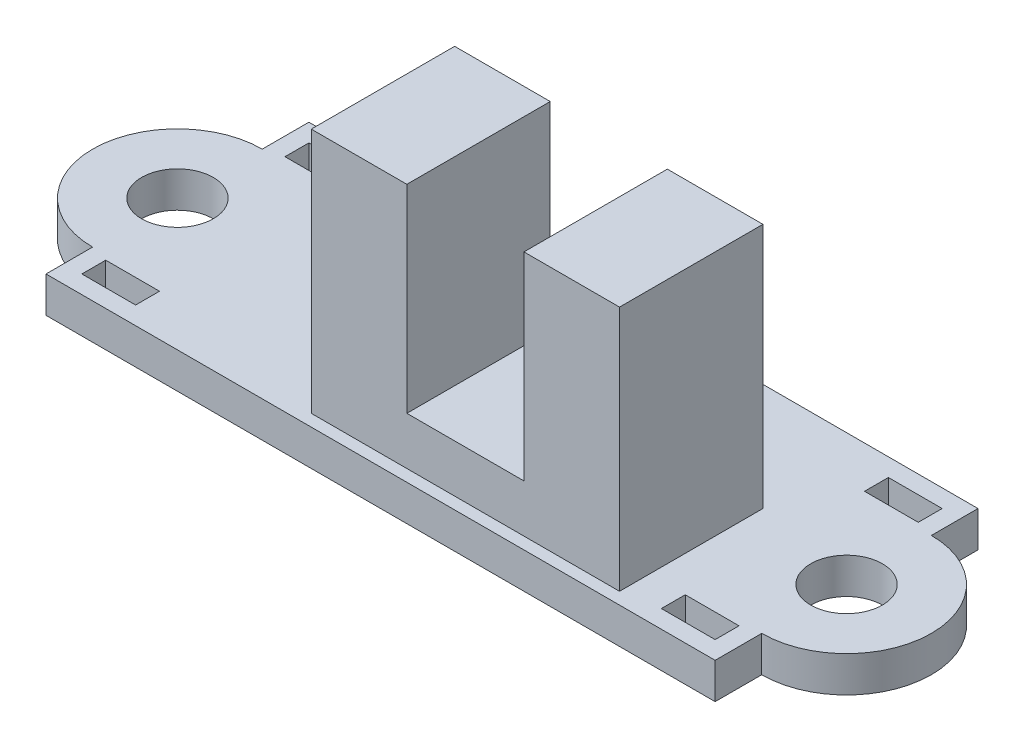
ISO-10303-21;
HEADER;
FILE_DESCRIPTION(('STEP AP214'),'2;1');
FILE_NAME('part.step','',(''),(''),'','','');
FILE_SCHEMA(('AUTOMOTIVE_DESIGN { 1 0 10303 214 1 1 1 1 }'));
ENDSEC;
DATA;
#1=APPLICATION_CONTEXT('core data for automotive mechanical design processes');
#2=APPLICATION_PROTOCOL_DEFINITION('international standard','automotive_design',2000,#1);
#3=PRODUCT_CONTEXT('',#1,'mechanical');
#4=PRODUCT('Part','Part','',(#3));
#5=PRODUCT_RELATED_PRODUCT_CATEGORY('part','',(#4));
#6=PRODUCT_DEFINITION_FORMATION('','',#4);
#7=PRODUCT_DEFINITION_CONTEXT('part definition',#1,'design');
#8=PRODUCT_DEFINITION('design','',#6,#7);
#9=PRODUCT_DEFINITION_SHAPE('','',#8);
#10=(LENGTH_UNIT() NAMED_UNIT(*) SI_UNIT(.MILLI.,.METRE.));
#11=(NAMED_UNIT(*) PLANE_ANGLE_UNIT() SI_UNIT($,.RADIAN.));
#12=(NAMED_UNIT(*) SI_UNIT($,.STERADIAN.) SOLID_ANGLE_UNIT());
#13=UNCERTAINTY_MEASURE_WITH_UNIT(LENGTH_MEASURE(1.E-05),#10,'distance_accuracy_value','');
#14=(GEOMETRIC_REPRESENTATION_CONTEXT(3) GLOBAL_UNCERTAINTY_ASSIGNED_CONTEXT((#13)) GLOBAL_UNIT_ASSIGNED_CONTEXT((#10,
#11,#12)) REPRESENTATION_CONTEXT('',''));
#15=CARTESIAN_POINT('',(0.,0.,0.));
#16=DIRECTION('',(0.,0.,1.));
#17=DIRECTION('',(1.,0.,0.));
#18=AXIS2_PLACEMENT_3D('',#15,#16,#17);
#19=CARTESIAN_POINT('',(0.,11.8,0.));
#20=DIRECTION('',(0.,1.,0.));
#21=DIRECTION('',(0.,0.,1.));
#22=AXIS2_PLACEMENT_3D('',#19,#20,#21);
#23=PLANE('',#22);
#24=DIRECTION('',(0.,0.,1.));
#25=VECTOR('',#24,1.);
#26=CARTESIAN_POINT('',(0.600000000000003,11.8,5.));
#27=LINE('',#26,#25);
#28=CARTESIAN_POINT('',(0.600000000000003,11.8,-0.999999999999997));
#29=VERTEX_POINT('',#28);
#30=CARTESIAN_POINT('',(0.600000000000003,11.8,5.));
#31=VERTEX_POINT('',#30);
#32=EDGE_CURVE('E131',#29,#31,#27,.T.);
#33=ORIENTED_EDGE('',*,*,#32,.F.);
#34=DIRECTION('',(-1.,0.,0.));
#35=VECTOR('',#34,1.);
#36=CARTESIAN_POINT('',(9.5,11.8,-0.999999999999997));
#37=LINE('',#36,#35);
#38=CARTESIAN_POINT('',(-3.4,11.8,-0.999999999999996));
#39=VERTEX_POINT('',#38);
#40=EDGE_CURVE('E162',#29,#39,#37,.T.);
#41=ORIENTED_EDGE('',*,*,#40,.T.);
#42=DIRECTION('',(0.,0.,1.));
#43=VECTOR('',#42,1.);
#44=CARTESIAN_POINT('',(-3.4,11.8,5.));
#45=LINE('',#44,#43);
#46=CARTESIAN_POINT('',(-3.4,11.8,5.));
#47=VERTEX_POINT('',#46);
#48=EDGE_CURVE('E164',#39,#47,#45,.T.);
#49=ORIENTED_EDGE('',*,*,#48,.T.);
#50=DIRECTION('',(1.,0.,0.));
#51=VECTOR('',#50,1.);
#52=CARTESIAN_POINT('',(9.5,11.8,5.));
#53=LINE('',#52,#51);
#54=EDGE_CURVE('E166',#47,#31,#53,.T.);
#55=ORIENTED_EDGE('',*,*,#54,.T.);
#56=EDGE_LOOP('',(#33,#41,#49,#55));
#57=FACE_BOUND('',#56,.T.);
#58=ADVANCED_FACE('F51',(#57),#23,.T.);
#59=CARTESIAN_POINT('',(9.5,11.8,5.));
#60=DIRECTION('',(-1.,0.,0.));
#61=DIRECTION('',(0.,0.,1.));
#62=AXIS2_PLACEMENT_3D('',#59,#60,#61);
#63=PLANE('',#62);
#64=DIRECTION('',(0.,0.,-1.));
#65=VECTOR('',#64,1.);
#66=CARTESIAN_POINT('',(9.5,1.5,5.));
#67=LINE('',#66,#65);
#68=CARTESIAN_POINT('',(9.5,1.5,5.));
#69=VERTEX_POINT('',#68);
#70=CARTESIAN_POINT('',(9.5,1.5,-0.999999999999997));
#71=VERTEX_POINT('',#70);
#72=EDGE_CURVE('E156',#69,#71,#67,.T.);
#73=ORIENTED_EDGE('',*,*,#72,.T.);
#74=DIRECTION('',(0.,-1.,0.));
#75=VECTOR('',#74,1.);
#76=CARTESIAN_POINT('',(9.5,11.8,-0.999999999999997));
#77=LINE('',#76,#75);
#78=CARTESIAN_POINT('',(9.5,11.8,-0.999999999999997));
#79=VERTEX_POINT('',#78);
#80=EDGE_CURVE('E12',#79,#71,#77,.T.);
#81=ORIENTED_EDGE('',*,*,#80,.F.);
#82=DIRECTION('',(0.,0.,-1.));
#83=VECTOR('',#82,1.);
#84=CARTESIAN_POINT('',(9.5,11.8,5.));
#85=LINE('',#84,#83);
#86=CARTESIAN_POINT('',(9.5,11.8,5.));
#87=VERTEX_POINT('',#86);
#88=EDGE_CURVE('E160',#87,#79,#85,.T.);
#89=ORIENTED_EDGE('',*,*,#88,.F.);
#90=DIRECTION('',(0.,-1.,0.));
#91=VECTOR('',#90,1.);
#92=CARTESIAN_POINT('',(9.5,11.8,5.));
#93=LINE('',#92,#91);
#94=EDGE_CURVE('E168',#87,#69,#93,.T.);
#95=ORIENTED_EDGE('',*,*,#94,.T.);
#96=EDGE_LOOP('',(#73,#81,#89,#95));
#97=FACE_BOUND('',#96,.T.);
#98=ADVANCED_FACE('F53',(#97),#63,.F.);
#99=CARTESIAN_POINT('',(9.5,11.8,-0.999999999999997));
#100=DIRECTION('',(0.,0.,1.));
#101=DIRECTION('',(1.,0.,0.));
#102=AXIS2_PLACEMENT_3D('',#99,#100,#101);
#103=PLANE('',#102);
#104=ORIENTED_EDGE('',*,*,#40,.F.);
#105=DIRECTION('',(0.,1.,0.));
#106=VECTOR('',#105,1.);
#107=CARTESIAN_POINT('',(0.600000000000003,3.5,-0.999999999999997));
#108=LINE('',#107,#106);
#109=CARTESIAN_POINT('',(0.600000000000003,3.5,-0.999999999999997));
#110=VERTEX_POINT('',#109);
#111=EDGE_CURVE('E154',#110,#29,#108,.T.);
#112=ORIENTED_EDGE('',*,*,#111,.F.);
#113=DIRECTION('',(-1.,0.,0.));
#114=VECTOR('',#113,1.);
#115=CARTESIAN_POINT('',(0.600000000000003,3.5,-0.999999999999997));
#116=LINE('',#115,#114);
#117=CARTESIAN_POINT('',(5.5,3.5,-0.999999999999997));
#118=VERTEX_POINT('',#117);
#119=EDGE_CURVE('E135',#118,#110,#116,.T.);
#120=ORIENTED_EDGE('',*,*,#119,.F.);
#121=DIRECTION('',(0.,1.,0.));
#122=VECTOR('',#121,1.);
#123=CARTESIAN_POINT('',(5.5,3.5,-0.999999999999997));
#124=LINE('',#123,#122);
#125=CARTESIAN_POINT('',(5.5,11.8,-0.999999999999997));
#126=VERTEX_POINT('',#125);
#127=EDGE_CURVE('E157',#118,#126,#124,.T.);
#128=ORIENTED_EDGE('',*,*,#127,.T.);
#129=EDGE_CURVE('E103',#79,#126,#37,.T.);
#130=ORIENTED_EDGE('',*,*,#129,.F.);
#131=ORIENTED_EDGE('',*,*,#80,.T.);
#132=DIRECTION('',(-1.,0.,0.));
#133=VECTOR('',#132,1.);
#134=CARTESIAN_POINT('',(9.5,1.5,-0.999999999999997));
#135=LINE('',#134,#133);
#136=CARTESIAN_POINT('',(-3.4,1.5,-0.999999999999996));
#137=VERTEX_POINT('',#136);
#138=EDGE_CURVE('E171',#71,#137,#135,.T.);
#139=ORIENTED_EDGE('',*,*,#138,.T.);
#140=DIRECTION('',(0.,-1.,0.));
#141=VECTOR('',#140,1.);
#142=CARTESIAN_POINT('',(-3.4,11.8,-0.999999999999996));
#143=LINE('',#142,#141);
#144=EDGE_CURVE('E59',#39,#137,#143,.T.);
#145=ORIENTED_EDGE('',*,*,#144,.F.);
#146=EDGE_LOOP('',(#104,#112,#120,#128,#130,#131,#139,#145));
#147=FACE_BOUND('',#146,.T.);
#148=ADVANCED_FACE('F194',(#147),#103,.F.);
#149=CARTESIAN_POINT('',(-3.4,11.8,5.));
#150=DIRECTION('',(1.,0.,0.));
#151=DIRECTION('',(0.,0.,-1.));
#152=AXIS2_PLACEMENT_3D('',#149,#150,#151);
#153=PLANE('',#152);
#154=DIRECTION('',(0.,0.,1.));
#155=VECTOR('',#154,1.);
#156=CARTESIAN_POINT('',(-3.4,1.5,5.));
#157=LINE('',#156,#155);
#158=CARTESIAN_POINT('',(-3.4,1.5,5.));
#159=VERTEX_POINT('',#158);
#160=EDGE_CURVE('E173',#137,#159,#157,.T.);
#161=ORIENTED_EDGE('',*,*,#160,.T.);
#162=DIRECTION('',(0.,-1.,0.));
#163=VECTOR('',#162,1.);
#164=CARTESIAN_POINT('',(-3.4,11.8,5.));
#165=LINE('',#164,#163);
#166=EDGE_CURVE('E177',#47,#159,#165,.T.);
#167=ORIENTED_EDGE('',*,*,#166,.F.);
#168=ORIENTED_EDGE('',*,*,#48,.F.);
#169=ORIENTED_EDGE('',*,*,#144,.T.);
#170=EDGE_LOOP('',(#161,#167,#168,#169));
#171=FACE_BOUND('',#170,.T.);
#172=ADVANCED_FACE('F183',(#171),#153,.F.);
#173=CARTESIAN_POINT('',(9.5,11.8,5.));
#174=DIRECTION('',(0.,0.,-1.));
#175=DIRECTION('',(-1.,0.,0.));
#176=AXIS2_PLACEMENT_3D('',#173,#174,#175);
#177=PLANE('',#176);
#178=DIRECTION('',(1.,0.,0.));
#179=VECTOR('',#178,1.);
#180=CARTESIAN_POINT('',(0.600000000000003,3.5,5.));
#181=LINE('',#180,#179);
#182=CARTESIAN_POINT('',(0.600000000000003,3.5,5.));
#183=VERTEX_POINT('',#182);
#184=CARTESIAN_POINT('',(5.5,3.5,5.));
#185=VERTEX_POINT('',#184);
#186=EDGE_CURVE('E141',#183,#185,#181,.T.);
#187=ORIENTED_EDGE('',*,*,#186,.F.);
#188=DIRECTION('',(0.,1.,0.));
#189=VECTOR('',#188,1.);
#190=CARTESIAN_POINT('',(0.600000000000003,3.5,5.));
#191=LINE('',#190,#189);
#192=EDGE_CURVE('E125',#183,#31,#191,.T.);
#193=ORIENTED_EDGE('',*,*,#192,.T.);
#194=ORIENTED_EDGE('',*,*,#54,.F.);
#195=ORIENTED_EDGE('',*,*,#166,.T.);
#196=DIRECTION('',(1.,0.,0.));
#197=VECTOR('',#196,1.);
#198=CARTESIAN_POINT('',(9.5,1.5,5.));
#199=LINE('',#198,#197);
#200=EDGE_CURVE('E96',#159,#69,#199,.T.);
#201=ORIENTED_EDGE('',*,*,#200,.T.);
#202=ORIENTED_EDGE('',*,*,#94,.F.);
#203=CARTESIAN_POINT('',(5.5,11.8,5.));
#204=VERTEX_POINT('',#203);
#205=EDGE_CURVE('E74',#204,#87,#53,.T.);
#206=ORIENTED_EDGE('',*,*,#205,.F.);
#207=DIRECTION('',(0.,1.,0.));
#208=VECTOR('',#207,1.);
#209=CARTESIAN_POINT('',(5.5,3.5,5.));
#210=LINE('',#209,#208);
#211=EDGE_CURVE('E66',#185,#204,#210,.T.);
#212=ORIENTED_EDGE('',*,*,#211,.F.);
#213=EDGE_LOOP('',(#187,#193,#194,#195,#201,#202,#206,#212));
#214=FACE_BOUND('',#213,.T.);
#215=ADVANCED_FACE('F146',(#214),#177,.F.);
#216=DIRECTION('',(0.,0.,-1.));
#217=VECTOR('',#216,1.);
#218=CARTESIAN_POINT('',(5.5,11.8,5.));
#219=LINE('',#218,#217);
#220=EDGE_CURVE('E144',#204,#126,#219,.T.);
#221=ORIENTED_EDGE('',*,*,#220,.F.);
#222=ORIENTED_EDGE('',*,*,#205,.T.);
#223=ORIENTED_EDGE('',*,*,#88,.T.);
#224=ORIENTED_EDGE('',*,*,#129,.T.);
#225=EDGE_LOOP('',(#221,#222,#223,#224));
#226=FACE_BOUND('',#225,.T.);
#227=ADVANCED_FACE('F192',(#226),#23,.T.);
#228=CARTESIAN_POINT('',(0.,1.5,0.));
#229=DIRECTION('',(0.,1.,0.));
#230=DIRECTION('',(0.,0.,1.));
#231=AXIS2_PLACEMENT_3D('',#228,#229,#230);
#232=PLANE('',#231);
#233=ORIENTED_EDGE('',*,*,#72,.F.);
#234=ORIENTED_EDGE('',*,*,#200,.F.);
#235=ORIENTED_EDGE('',*,*,#160,.F.);
#236=ORIENTED_EDGE('',*,*,#138,.F.);
#237=EDGE_LOOP('',(#233,#234,#235,#236));
#238=FACE_BOUND('',#237,.T.);
#239=ADVANCED_FACE('F188',(#238),#232,.F.);
#240=CARTESIAN_POINT('',(0.600000000000003,3.5,5.));
#241=DIRECTION('',(-1.,0.,0.));
#242=DIRECTION('',(0.,0.,1.));
#243=AXIS2_PLACEMENT_3D('',#240,#241,#242);
#244=PLANE('',#243);
#245=ORIENTED_EDGE('',*,*,#32,.T.);
#246=ORIENTED_EDGE('',*,*,#192,.F.);
#247=DIRECTION('',(0.,0.,1.));
#248=VECTOR('',#247,1.);
#249=CARTESIAN_POINT('',(0.600000000000003,3.5,5.));
#250=LINE('',#249,#248);
#251=EDGE_CURVE('E128',#110,#183,#250,.T.);
#252=ORIENTED_EDGE('',*,*,#251,.F.);
#253=ORIENTED_EDGE('',*,*,#111,.T.);
#254=EDGE_LOOP('',(#245,#246,#252,#253));
#255=FACE_BOUND('',#254,.T.);
#256=ADVANCED_FACE('F127',(#255),#244,.F.);
#257=CARTESIAN_POINT('',(5.5,3.5,5.));
#258=DIRECTION('',(1.,0.,0.));
#259=DIRECTION('',(0.,0.,-1.));
#260=AXIS2_PLACEMENT_3D('',#257,#258,#259);
#261=PLANE('',#260);
#262=ORIENTED_EDGE('',*,*,#220,.T.);
#263=ORIENTED_EDGE('',*,*,#127,.F.);
#264=DIRECTION('',(0.,0.,-1.));
#265=VECTOR('',#264,1.);
#266=CARTESIAN_POINT('',(5.5,3.5,5.));
#267=LINE('',#266,#265);
#268=EDGE_CURVE('E147',#185,#118,#267,.T.);
#269=ORIENTED_EDGE('',*,*,#268,.F.);
#270=ORIENTED_EDGE('',*,*,#211,.T.);
#271=EDGE_LOOP('',(#262,#263,#269,#270));
#272=FACE_BOUND('',#271,.T.);
#273=ADVANCED_FACE('F193',(#272),#261,.F.);
#274=CARTESIAN_POINT('',(0.,3.5,0.));
#275=DIRECTION('',(0.,-1.,0.));
#276=DIRECTION('',(0.,0.,-1.));
#277=AXIS2_PLACEMENT_3D('',#274,#275,#276);
#278=PLANE('',#277);
#279=ORIENTED_EDGE('',*,*,#251,.T.);
#280=ORIENTED_EDGE('',*,*,#186,.T.);
#281=ORIENTED_EDGE('',*,*,#268,.T.);
#282=ORIENTED_EDGE('',*,*,#119,.T.);
#283=EDGE_LOOP('',(#279,#280,#281,#282));
#284=FACE_BOUND('',#283,.T.);
#285=ADVANCED_FACE('F139',(#284),#278,.F.);
#286=CLOSED_SHELL('',(#58,#98,#148,#172,#215,#227,#239,#256,#273,#285));
#287=MANIFOLD_SOLID_BREP('B2',#286);
#288=CARTESIAN_POINT('',(-14.,1.5,0.));
#289=DIRECTION('',(0.,1.,0.));
#290=DIRECTION('',(0.,0.,1.));
#291=AXIS2_PLACEMENT_3D('',#288,#289,#290);
#292=PLANE('',#291);
#293=DIRECTION('',(0.,0.,-1.));
#294=VECTOR('',#293,1.);
#295=CARTESIAN_POINT('',(13.25,1.5,4.75));
#296=LINE('',#295,#294);
#297=CARTESIAN_POINT('',(13.25,1.5,4.75));
#298=VERTEX_POINT('',#297);
#299=CARTESIAN_POINT('',(13.25,1.5,3.75));
#300=VERTEX_POINT('',#299);
#301=EDGE_CURVE('E271',#298,#300,#296,.T.);
#302=ORIENTED_EDGE('',*,*,#301,.F.);
#303=DIRECTION('',(1.,0.,0.));
#304=VECTOR('',#303,1.);
#305=CARTESIAN_POINT('',(13.25,1.5,4.75));
#306=LINE('',#305,#304);
#307=CARTESIAN_POINT('',(11.,1.5,4.75));
#308=VERTEX_POINT('',#307);
#309=EDGE_CURVE('E496',#308,#298,#306,.T.);
#310=ORIENTED_EDGE('',*,*,#309,.F.);
#311=DIRECTION('',(0.,0.,1.));
#312=VECTOR('',#311,1.);
#313=CARTESIAN_POINT('',(11.,1.5,4.75));
#314=LINE('',#313,#312);
#315=CARTESIAN_POINT('',(11.,1.5,3.75));
#316=VERTEX_POINT('',#315);
#317=EDGE_CURVE('E510',#316,#308,#314,.T.);
#318=ORIENTED_EDGE('',*,*,#317,.F.);
#319=DIRECTION('',(-1.,0.,0.));
#320=VECTOR('',#319,1.);
#321=CARTESIAN_POINT('',(13.25,1.5,3.75));
#322=LINE('',#321,#320);
#323=EDGE_CURVE('E507',#300,#316,#322,.T.);
#324=ORIENTED_EDGE('',*,*,#323,.F.);
#325=EDGE_LOOP('',(#302,#310,#318,#324));
#326=FACE_BOUND('',#325,.T.);
#327=DIRECTION('',(-1.,0.,0.));
#328=VECTOR('',#327,1.);
#329=CARTESIAN_POINT('',(13.25,1.5,-4.75));
#330=LINE('',#329,#328);
#331=CARTESIAN_POINT('',(13.25,1.5,-4.75));
#332=VERTEX_POINT('',#331);
#333=CARTESIAN_POINT('',(11.,1.5,-4.75));
#334=VERTEX_POINT('',#333);
#335=EDGE_CURVE('E279',#332,#334,#330,.T.);
#336=ORIENTED_EDGE('',*,*,#335,.F.);
#337=DIRECTION('',(0.,0.,-1.));
#338=VECTOR('',#337,1.);
#339=CARTESIAN_POINT('',(13.25,1.5,-4.75));
#340=LINE('',#339,#338);
#341=CARTESIAN_POINT('',(13.25,1.5,-3.75));
#342=VERTEX_POINT('',#341);
#343=EDGE_CURVE('E466',#342,#332,#340,.T.);
#344=ORIENTED_EDGE('',*,*,#343,.F.);
#345=DIRECTION('',(1.,0.,0.));
#346=VECTOR('',#345,1.);
#347=CARTESIAN_POINT('',(13.25,1.5,-3.75));
#348=LINE('',#347,#346);
#349=CARTESIAN_POINT('',(11.,1.5,-3.75));
#350=VERTEX_POINT('',#349);
#351=EDGE_CURVE('E481',#350,#342,#348,.T.);
#352=ORIENTED_EDGE('',*,*,#351,.F.);
#353=DIRECTION('',(0.,0.,1.));
#354=VECTOR('',#353,1.);
#355=CARTESIAN_POINT('',(11.,1.5,-4.75));
#356=LINE('',#355,#354);
#357=EDGE_CURVE('E477',#334,#350,#356,.T.);
#358=ORIENTED_EDGE('',*,*,#357,.F.);
#359=EDGE_LOOP('',(#336,#344,#352,#358));
#360=FACE_BOUND('',#359,.T.);
#361=DIRECTION('',(0.,0.,1.));
#362=VECTOR('',#361,1.);
#363=CARTESIAN_POINT('',(-13.25,1.5,-4.75));
#364=LINE('',#363,#362);
#365=CARTESIAN_POINT('',(-13.25,1.5,-4.75));
#366=VERTEX_POINT('',#365);
#367=CARTESIAN_POINT('',(-13.25,1.5,-3.75));
#368=VERTEX_POINT('',#367);
#369=EDGE_CURVE('E424',#366,#368,#364,.T.);
#370=ORIENTED_EDGE('',*,*,#369,.F.);
#371=DIRECTION('',(-1.,0.,0.));
#372=VECTOR('',#371,1.);
#373=CARTESIAN_POINT('',(-13.25,1.5,-4.75));
#374=LINE('',#373,#372);
#375=CARTESIAN_POINT('',(-11.,1.5,-4.75));
#376=VERTEX_POINT('',#375);
#377=EDGE_CURVE('E442',#376,#366,#374,.T.);
#378=ORIENTED_EDGE('',*,*,#377,.F.);
#379=DIRECTION('',(0.,0.,-1.));
#380=VECTOR('',#379,1.);
#381=CARTESIAN_POINT('',(-11.,1.5,-4.75));
#382=LINE('',#381,#380);
#383=CARTESIAN_POINT('',(-11.,1.5,-3.75));
#384=VERTEX_POINT('',#383);
#385=EDGE_CURVE('E445',#384,#376,#382,.T.);
#386=ORIENTED_EDGE('',*,*,#385,.F.);
#387=DIRECTION('',(1.,0.,0.));
#388=VECTOR('',#387,1.);
#389=CARTESIAN_POINT('',(-13.25,1.5,-3.75));
#390=LINE('',#389,#388);
#391=EDGE_CURVE('E451',#368,#384,#390,.T.);
#392=ORIENTED_EDGE('',*,*,#391,.F.);
#393=EDGE_LOOP('',(#370,#378,#386,#392));
#394=FACE_BOUND('',#393,.T.);
#395=DIRECTION('',(0.,0.,1.));
#396=VECTOR('',#395,1.);
#397=CARTESIAN_POINT('',(-13.25,1.5,4.75));
#398=LINE('',#397,#396);
#399=CARTESIAN_POINT('',(-13.25,1.5,3.75));
#400=VERTEX_POINT('',#399);
#401=CARTESIAN_POINT('',(-13.25,1.5,4.75));
#402=VERTEX_POINT('',#401);
#403=EDGE_CURVE('E458',#400,#402,#398,.T.);
#404=ORIENTED_EDGE('',*,*,#403,.F.);
#405=DIRECTION('',(-1.,0.,0.));
#406=VECTOR('',#405,1.);
#407=CARTESIAN_POINT('',(-13.25,1.5,3.75));
#408=LINE('',#407,#406);
#409=CARTESIAN_POINT('',(-11.,1.5,3.75));
#410=VERTEX_POINT('',#409);
#411=EDGE_CURVE('E525',#410,#400,#408,.T.);
#412=ORIENTED_EDGE('',*,*,#411,.F.);
#413=DIRECTION('',(0.,0.,-1.));
#414=VECTOR('',#413,1.);
#415=CARTESIAN_POINT('',(-11.,1.5,4.75));
#416=LINE('',#415,#414);
#417=CARTESIAN_POINT('',(-11.,1.5,4.75));
#418=VERTEX_POINT('',#417);
#419=EDGE_CURVE('E539',#418,#410,#416,.T.);
#420=ORIENTED_EDGE('',*,*,#419,.F.);
#421=DIRECTION('',(1.,0.,0.));
#422=VECTOR('',#421,1.);
#423=CARTESIAN_POINT('',(-13.25,1.5,4.75));
#424=LINE('',#423,#422);
#425=EDGE_CURVE('E536',#402,#418,#424,.T.);
#426=ORIENTED_EDGE('',*,*,#425,.F.);
#427=EDGE_LOOP('',(#404,#412,#420,#426));
#428=FACE_BOUND('',#427,.T.);
#429=CARTESIAN_POINT('',(-14.,1.5,0.));
#430=DIRECTION('',(0.,1.,0.));
#431=DIRECTION('',(0.,0.,1.));
#432=AXIS2_PLACEMENT_3D('',#429,#430,#431);
#433=CIRCLE('',#432,1.5);
#434=CARTESIAN_POINT('',(-14.,1.5,1.5));
#435=VERTEX_POINT('',#434);
#436=EDGE_CURVE('E559',#435,#435,#433,.T.);
#437=ORIENTED_EDGE('',*,*,#436,.F.);
#438=EDGE_LOOP('',(#437));
#439=FACE_BOUND('',#438,.T.);
#440=CARTESIAN_POINT('',(-14.,1.5,0.));
#441=DIRECTION('',(0.,1.,0.));
#442=DIRECTION('',(0.,0.,1.));
#443=AXIS2_PLACEMENT_3D('',#440,#441,#442);
#444=CIRCLE('',#443,3.55);
#445=CARTESIAN_POINT('',(-14.,1.5,-3.55));
#446=VERTEX_POINT('',#445);
#447=CARTESIAN_POINT('',(-14.,1.5,3.55));
#448=VERTEX_POINT('',#447);
#449=EDGE_CURVE('E565',#446,#448,#444,.T.);
#450=ORIENTED_EDGE('',*,*,#449,.T.);
#451=DIRECTION('',(0.,0.,1.));
#452=VECTOR('',#451,1.);
#453=CARTESIAN_POINT('',(-14.,1.5,3.55));
#454=LINE('',#453,#452);
#455=CARTESIAN_POINT('',(-14.,1.5,5.5));
#456=VERTEX_POINT('',#455);
#457=EDGE_CURVE('E568',#448,#456,#454,.T.);
#458=ORIENTED_EDGE('',*,*,#457,.T.);
#459=DIRECTION('',(1.,0.,0.));
#460=VECTOR('',#459,1.);
#461=CARTESIAN_POINT('',(-14.,1.5,5.5));
#462=LINE('',#461,#460);
#463=CARTESIAN_POINT('',(14.,1.5,5.5));
#464=VERTEX_POINT('',#463);
#465=EDGE_CURVE('E571',#456,#464,#462,.T.);
#466=ORIENTED_EDGE('',*,*,#465,.T.);
#467=DIRECTION('',(0.,0.,-1.));
#468=VECTOR('',#467,1.);
#469=CARTESIAN_POINT('',(14.,1.5,3.55));
#470=LINE('',#469,#468);
#471=CARTESIAN_POINT('',(14.,1.5,3.55));
#472=VERTEX_POINT('',#471);
#473=EDGE_CURVE('E573',#464,#472,#470,.T.);
#474=ORIENTED_EDGE('',*,*,#473,.T.);
#475=CARTESIAN_POINT('',(14.,1.5,0.));
#476=DIRECTION('',(0.,1.,0.));
#477=DIRECTION('',(0.,0.,-1.));
#478=AXIS2_PLACEMENT_3D('',#475,#476,#477);
#479=CIRCLE('',#478,3.55);
#480=CARTESIAN_POINT('',(14.,1.5,-3.55));
#481=VERTEX_POINT('',#480);
#482=EDGE_CURVE('E575',#472,#481,#479,.T.);
#483=ORIENTED_EDGE('',*,*,#482,.T.);
#484=DIRECTION('',(0.,0.,-1.));
#485=VECTOR('',#484,1.);
#486=CARTESIAN_POINT('',(14.,1.5,-3.55));
#487=LINE('',#486,#485);
#488=CARTESIAN_POINT('',(14.,1.5,-5.5));
#489=VERTEX_POINT('',#488);
#490=EDGE_CURVE('E577',#481,#489,#487,.T.);
#491=ORIENTED_EDGE('',*,*,#490,.T.);
#492=DIRECTION('',(-1.,0.,0.));
#493=VECTOR('',#492,1.);
#494=CARTESIAN_POINT('',(-14.,1.5,-5.5));
#495=LINE('',#494,#493);
#496=CARTESIAN_POINT('',(-14.,1.5,-5.5));
#497=VERTEX_POINT('',#496);
#498=EDGE_CURVE('E579',#489,#497,#495,.T.);
#499=ORIENTED_EDGE('',*,*,#498,.T.);
#500=DIRECTION('',(0.,0.,1.));
#501=VECTOR('',#500,1.);
#502=CARTESIAN_POINT('',(-14.,1.5,-3.55));
#503=LINE('',#502,#501);
#504=EDGE_CURVE('E581',#497,#446,#503,.T.);
#505=ORIENTED_EDGE('',*,*,#504,.T.);
#506=EDGE_LOOP('',(#450,#458,#466,#474,#483,#491,#499,#505));
#507=FACE_BOUND('',#506,.T.);
#508=CARTESIAN_POINT('',(14.,1.5,0.));
#509=DIRECTION('',(0.,1.,0.));
#510=DIRECTION('',(0.,0.,1.));
#511=AXIS2_PLACEMENT_3D('',#508,#509,#510);
#512=CIRCLE('',#511,1.5);
#513=CARTESIAN_POINT('',(14.,1.5,1.5));
#514=VERTEX_POINT('',#513);
#515=EDGE_CURVE('E553',#514,#514,#512,.T.);
#516=ORIENTED_EDGE('',*,*,#515,.F.);
#517=EDGE_LOOP('',(#516));
#518=FACE_BOUND('',#517,.T.);
#519=ADVANCED_FACE('F256',(#326,#360,#394,#428,#439,#507,#518),#292,.T.);
#520=CARTESIAN_POINT('',(-14.,0.,0.));
#521=DIRECTION('',(0.,1.,0.));
#522=DIRECTION('',(0.,0.,1.));
#523=AXIS2_PLACEMENT_3D('',#520,#521,#522);
#524=PLANE('',#523);
#525=DIRECTION('',(1.,0.,0.));
#526=VECTOR('',#525,1.);
#527=CARTESIAN_POINT('',(13.25,0.,4.75));
#528=LINE('',#527,#526);
#529=CARTESIAN_POINT('',(11.,0.,4.75));
#530=VERTEX_POINT('',#529);
#531=CARTESIAN_POINT('',(13.25,0.,4.75));
#532=VERTEX_POINT('',#531);
#533=EDGE_CURVE('E502',#530,#532,#528,.T.);
#534=ORIENTED_EDGE('',*,*,#533,.T.);
#535=DIRECTION('',(0.,0.,-1.));
#536=VECTOR('',#535,1.);
#537=CARTESIAN_POINT('',(13.25,0.,4.75));
#538=LINE('',#537,#536);
#539=CARTESIAN_POINT('',(13.25,0.,3.75));
#540=VERTEX_POINT('',#539);
#541=EDGE_CURVE('E492',#532,#540,#538,.T.);
#542=ORIENTED_EDGE('',*,*,#541,.T.);
#543=DIRECTION('',(-1.,0.,0.));
#544=VECTOR('',#543,1.);
#545=CARTESIAN_POINT('',(13.25,0.,3.75));
#546=LINE('',#545,#544);
#547=CARTESIAN_POINT('',(11.,0.,3.75));
#548=VERTEX_POINT('',#547);
#549=EDGE_CURVE('E495',#540,#548,#546,.T.);
#550=ORIENTED_EDGE('',*,*,#549,.T.);
#551=DIRECTION('',(0.,0.,1.));
#552=VECTOR('',#551,1.);
#553=CARTESIAN_POINT('',(11.,0.,4.75));
#554=LINE('',#553,#552);
#555=EDGE_CURVE('E499',#548,#530,#554,.T.);
#556=ORIENTED_EDGE('',*,*,#555,.T.);
#557=EDGE_LOOP('',(#534,#542,#550,#556));
#558=FACE_BOUND('',#557,.T.);
#559=DIRECTION('',(0.,0.,-1.));
#560=VECTOR('',#559,1.);
#561=CARTESIAN_POINT('',(13.25,0.,-4.75));
#562=LINE('',#561,#560);
#563=CARTESIAN_POINT('',(13.25,0.,-3.75));
#564=VERTEX_POINT('',#563);
#565=CARTESIAN_POINT('',(13.25,0.,-4.75));
#566=VERTEX_POINT('',#565);
#567=EDGE_CURVE('E472',#564,#566,#562,.T.);
#568=ORIENTED_EDGE('',*,*,#567,.T.);
#569=DIRECTION('',(-1.,0.,0.));
#570=VECTOR('',#569,1.);
#571=CARTESIAN_POINT('',(13.25,0.,-4.75));
#572=LINE('',#571,#570);
#573=CARTESIAN_POINT('',(11.,0.,-4.75));
#574=VERTEX_POINT('',#573);
#575=EDGE_CURVE('E462',#566,#574,#572,.T.);
#576=ORIENTED_EDGE('',*,*,#575,.T.);
#577=DIRECTION('',(0.,0.,1.));
#578=VECTOR('',#577,1.);
#579=CARTESIAN_POINT('',(11.,0.,-4.75));
#580=LINE('',#579,#578);
#581=CARTESIAN_POINT('',(11.,0.,-3.75));
#582=VERTEX_POINT('',#581);
#583=EDGE_CURVE('E465',#574,#582,#580,.T.);
#584=ORIENTED_EDGE('',*,*,#583,.T.);
#585=DIRECTION('',(1.,0.,0.));
#586=VECTOR('',#585,1.);
#587=CARTESIAN_POINT('',(13.25,0.,-3.75));
#588=LINE('',#587,#586);
#589=EDGE_CURVE('E469',#582,#564,#588,.T.);
#590=ORIENTED_EDGE('',*,*,#589,.T.);
#591=EDGE_LOOP('',(#568,#576,#584,#590));
#592=FACE_BOUND('',#591,.T.);
#593=DIRECTION('',(-1.,0.,0.));
#594=VECTOR('',#593,1.);
#595=CARTESIAN_POINT('',(-13.25,0.,-4.75));
#596=LINE('',#595,#594);
#597=CARTESIAN_POINT('',(-11.,0.,-4.75));
#598=VERTEX_POINT('',#597);
#599=CARTESIAN_POINT('',(-13.25,0.,-4.75));
#600=VERTEX_POINT('',#599);
#601=EDGE_CURVE('E429',#598,#600,#596,.T.);
#602=ORIENTED_EDGE('',*,*,#601,.T.);
#603=DIRECTION('',(0.,0.,1.));
#604=VECTOR('',#603,1.);
#605=CARTESIAN_POINT('',(-13.25,0.,-4.75));
#606=LINE('',#605,#604);
#607=CARTESIAN_POINT('',(-13.25,0.,-3.75));
#608=VERTEX_POINT('',#607);
#609=EDGE_CURVE('E421',#600,#608,#606,.T.);
#610=ORIENTED_EDGE('',*,*,#609,.T.);
#611=DIRECTION('',(1.,0.,0.));
#612=VECTOR('',#611,1.);
#613=CARTESIAN_POINT('',(-13.25,0.,-3.75));
#614=LINE('',#613,#612);
#615=CARTESIAN_POINT('',(-11.,0.,-3.75));
#616=VERTEX_POINT('',#615);
#617=EDGE_CURVE('E433',#608,#616,#614,.T.);
#618=ORIENTED_EDGE('',*,*,#617,.T.);
#619=DIRECTION('',(0.,0.,-1.));
#620=VECTOR('',#619,1.);
#621=CARTESIAN_POINT('',(-11.,0.,-4.75));
#622=LINE('',#621,#620);
#623=EDGE_CURVE('E437',#616,#598,#622,.T.);
#624=ORIENTED_EDGE('',*,*,#623,.T.);
#625=EDGE_LOOP('',(#602,#610,#618,#624));
#626=FACE_BOUND('',#625,.T.);
#627=DIRECTION('',(-1.,0.,0.));
#628=VECTOR('',#627,1.);
#629=CARTESIAN_POINT('',(-13.25,0.,3.75));
#630=LINE('',#629,#628);
#631=CARTESIAN_POINT('',(-11.,0.,3.75));
#632=VERTEX_POINT('',#631);
#633=CARTESIAN_POINT('',(-13.25,0.,3.75));
#634=VERTEX_POINT('',#633);
#635=EDGE_CURVE('E531',#632,#634,#630,.T.);
#636=ORIENTED_EDGE('',*,*,#635,.T.);
#637=DIRECTION('',(0.,0.,1.));
#638=VECTOR('',#637,1.);
#639=CARTESIAN_POINT('',(-13.25,0.,4.75));
#640=LINE('',#639,#638);
#641=CARTESIAN_POINT('',(-13.25,0.,4.75));
#642=VERTEX_POINT('',#641);
#643=EDGE_CURVE('E521',#634,#642,#640,.T.);
#644=ORIENTED_EDGE('',*,*,#643,.T.);
#645=DIRECTION('',(1.,0.,0.));
#646=VECTOR('',#645,1.);
#647=CARTESIAN_POINT('',(-13.25,0.,4.75));
#648=LINE('',#647,#646);
#649=CARTESIAN_POINT('',(-11.,0.,4.75));
#650=VERTEX_POINT('',#649);
#651=EDGE_CURVE('E524',#642,#650,#648,.T.);
#652=ORIENTED_EDGE('',*,*,#651,.T.);
#653=DIRECTION('',(0.,0.,-1.));
#654=VECTOR('',#653,1.);
#655=CARTESIAN_POINT('',(-11.,0.,4.75));
#656=LINE('',#655,#654);
#657=EDGE_CURVE('E528',#650,#632,#656,.T.);
#658=ORIENTED_EDGE('',*,*,#657,.T.);
#659=EDGE_LOOP('',(#636,#644,#652,#658));
#660=FACE_BOUND('',#659,.T.);
#661=CARTESIAN_POINT('',(-14.,0.,0.));
#662=DIRECTION('',(0.,1.,0.));
#663=DIRECTION('',(0.,0.,1.));
#664=AXIS2_PLACEMENT_3D('',#661,#662,#663);
#665=CIRCLE('',#664,3.55);
#666=CARTESIAN_POINT('',(-14.,0.,-3.55));
#667=VERTEX_POINT('',#666);
#668=CARTESIAN_POINT('',(-14.,0.,3.55));
#669=VERTEX_POINT('',#668);
#670=EDGE_CURVE('E562',#667,#669,#665,.T.);
#671=ORIENTED_EDGE('',*,*,#670,.F.);
#672=DIRECTION('',(0.,0.,1.));
#673=VECTOR('',#672,1.);
#674=CARTESIAN_POINT('',(-14.,0.,-3.55));
#675=LINE('',#674,#673);
#676=CARTESIAN_POINT('',(-14.,0.,-5.5));
#677=VERTEX_POINT('',#676);
#678=EDGE_CURVE('E569',#677,#667,#675,.T.);
#679=ORIENTED_EDGE('',*,*,#678,.F.);
#680=DIRECTION('',(-1.,0.,0.));
#681=VECTOR('',#680,1.);
#682=CARTESIAN_POINT('',(-14.,0.,-5.5));
#683=LINE('',#682,#681);
#684=CARTESIAN_POINT('',(14.,0.,-5.5));
#685=VERTEX_POINT('',#684);
#686=EDGE_CURVE('E596',#685,#677,#683,.T.);
#687=ORIENTED_EDGE('',*,*,#686,.F.);
#688=DIRECTION('',(0.,0.,-1.));
#689=VECTOR('',#688,1.);
#690=CARTESIAN_POINT('',(14.,0.,-3.55));
#691=LINE('',#690,#689);
#692=CARTESIAN_POINT('',(14.,0.,-3.55));
#693=VERTEX_POINT('',#692);
#694=EDGE_CURVE('E594',#693,#685,#691,.T.);
#695=ORIENTED_EDGE('',*,*,#694,.F.);
#696=CARTESIAN_POINT('',(14.,0.,0.));
#697=DIRECTION('',(0.,1.,0.));
#698=DIRECTION('',(0.,0.,-1.));
#699=AXIS2_PLACEMENT_3D('',#696,#697,#698);
#700=CIRCLE('',#699,3.55);
#701=CARTESIAN_POINT('',(14.,0.,3.55));
#702=VERTEX_POINT('',#701);
#703=EDGE_CURVE('E592',#702,#693,#700,.T.);
#704=ORIENTED_EDGE('',*,*,#703,.F.);
#705=DIRECTION('',(0.,0.,-1.));
#706=VECTOR('',#705,1.);
#707=CARTESIAN_POINT('',(14.,0.,3.55));
#708=LINE('',#707,#706);
#709=CARTESIAN_POINT('',(14.,0.,5.5));
#710=VERTEX_POINT('',#709);
#711=EDGE_CURVE('E590',#710,#702,#708,.T.);
#712=ORIENTED_EDGE('',*,*,#711,.F.);
#713=DIRECTION('',(1.,0.,0.));
#714=VECTOR('',#713,1.);
#715=CARTESIAN_POINT('',(-14.,0.,5.5));
#716=LINE('',#715,#714);
#717=CARTESIAN_POINT('',(-14.,0.,5.5));
#718=VERTEX_POINT('',#717);
#719=EDGE_CURVE('E588',#718,#710,#716,.T.);
#720=ORIENTED_EDGE('',*,*,#719,.F.);
#721=DIRECTION('',(0.,0.,1.));
#722=VECTOR('',#721,1.);
#723=CARTESIAN_POINT('',(-14.,0.,3.55));
#724=LINE('',#723,#722);
#725=EDGE_CURVE('E586',#669,#718,#724,.T.);
#726=ORIENTED_EDGE('',*,*,#725,.F.);
#727=EDGE_LOOP('',(#671,#679,#687,#695,#704,#712,#720,#726));
#728=FACE_BOUND('',#727,.T.);
#729=CARTESIAN_POINT('',(-14.,0.,0.));
#730=DIRECTION('',(0.,1.,0.));
#731=DIRECTION('',(0.,0.,1.));
#732=AXIS2_PLACEMENT_3D('',#729,#730,#731);
#733=CIRCLE('',#732,1.5);
#734=CARTESIAN_POINT('',(-14.,0.,1.5));
#735=VERTEX_POINT('',#734);
#736=EDGE_CURVE('E556',#735,#735,#733,.T.);
#737=ORIENTED_EDGE('',*,*,#736,.T.);
#738=EDGE_LOOP('',(#737));
#739=FACE_BOUND('',#738,.T.);
#740=CARTESIAN_POINT('',(14.,0.,0.));
#741=DIRECTION('',(0.,1.,0.));
#742=DIRECTION('',(0.,0.,1.));
#743=AXIS2_PLACEMENT_3D('',#740,#741,#742);
#744=CIRCLE('',#743,1.5);
#745=CARTESIAN_POINT('',(14.,0.,1.5));
#746=VERTEX_POINT('',#745);
#747=EDGE_CURVE('E546',#746,#746,#744,.T.);
#748=ORIENTED_EDGE('',*,*,#747,.T.);
#749=EDGE_LOOP('',(#748));
#750=FACE_BOUND('',#749,.T.);
#751=ADVANCED_FACE('F439',(#558,#592,#626,#660,#728,#739,#750),#524,.F.);
#752=CARTESIAN_POINT('',(-14.,1.5,0.));
#753=DIRECTION('',(0.,-1.,0.));
#754=DIRECTION('',(0.,0.,-1.));
#755=AXIS2_PLACEMENT_3D('',#752,#753,#754);
#756=CYLINDRICAL_SURFACE('',#755,3.55);
#757=ORIENTED_EDGE('',*,*,#670,.T.);
#758=DIRECTION('',(0.,-1.,0.));
#759=VECTOR('',#758,1.);
#760=CARTESIAN_POINT('',(-14.,1.5,3.55));
#761=LINE('',#760,#759);
#762=EDGE_CURVE('E49',#448,#669,#761,.T.);
#763=ORIENTED_EDGE('',*,*,#762,.F.);
#764=ORIENTED_EDGE('',*,*,#449,.F.);
#765=DIRECTION('',(0.,-1.,0.));
#766=VECTOR('',#765,1.);
#767=CARTESIAN_POINT('',(-14.,1.5,-3.55));
#768=LINE('',#767,#766);
#769=EDGE_CURVE('E583',#446,#667,#768,.T.);
#770=ORIENTED_EDGE('',*,*,#769,.T.);
#771=EDGE_LOOP('',(#757,#763,#764,#770));
#772=FACE_BOUND('',#771,.T.);
#773=ADVANCED_FACE('F258',(#772),#756,.T.);
#774=CARTESIAN_POINT('',(-14.,1.5,3.55));
#775=DIRECTION('',(1.,0.,0.));
#776=DIRECTION('',(0.,0.,-1.));
#777=AXIS2_PLACEMENT_3D('',#774,#775,#776);
#778=PLANE('',#777);
#779=ORIENTED_EDGE('',*,*,#725,.T.);
#780=DIRECTION('',(0.,-1.,0.));
#781=VECTOR('',#780,1.);
#782=CARTESIAN_POINT('',(-14.,1.5,5.5));
#783=LINE('',#782,#781);
#784=EDGE_CURVE('E264',#456,#718,#783,.T.);
#785=ORIENTED_EDGE('',*,*,#784,.F.);
#786=ORIENTED_EDGE('',*,*,#457,.F.);
#787=ORIENTED_EDGE('',*,*,#762,.T.);
#788=EDGE_LOOP('',(#779,#785,#786,#787));
#789=FACE_BOUND('',#788,.T.);
#790=ADVANCED_FACE('F643',(#789),#778,.F.);
#791=CARTESIAN_POINT('',(-14.,1.5,5.5));
#792=DIRECTION('',(0.,0.,-1.));
#793=DIRECTION('',(-1.,0.,0.));
#794=AXIS2_PLACEMENT_3D('',#791,#792,#793);
#795=PLANE('',#794);
#796=ORIENTED_EDGE('',*,*,#719,.T.);
#797=DIRECTION('',(0.,-1.,0.));
#798=VECTOR('',#797,1.);
#799=CARTESIAN_POINT('',(14.,1.5,5.5));
#800=LINE('',#799,#798);
#801=EDGE_CURVE('E613',#464,#710,#800,.T.);
#802=ORIENTED_EDGE('',*,*,#801,.F.);
#803=ORIENTED_EDGE('',*,*,#465,.F.);
#804=ORIENTED_EDGE('',*,*,#784,.T.);
#805=EDGE_LOOP('',(#796,#802,#803,#804));
#806=FACE_BOUND('',#805,.T.);
#807=ADVANCED_FACE('F620',(#806),#795,.F.);
#808=CARTESIAN_POINT('',(14.,1.5,3.55));
#809=DIRECTION('',(-1.,0.,0.));
#810=DIRECTION('',(0.,0.,1.));
#811=AXIS2_PLACEMENT_3D('',#808,#809,#810);
#812=PLANE('',#811);
#813=ORIENTED_EDGE('',*,*,#711,.T.);
#814=DIRECTION('',(0.,-1.,0.));
#815=VECTOR('',#814,1.);
#816=CARTESIAN_POINT('',(14.,1.5,3.55));
#817=LINE('',#816,#815);
#818=EDGE_CURVE('E610',#472,#702,#817,.T.);
#819=ORIENTED_EDGE('',*,*,#818,.F.);
#820=ORIENTED_EDGE('',*,*,#473,.F.);
#821=ORIENTED_EDGE('',*,*,#801,.T.);
#822=EDGE_LOOP('',(#813,#819,#820,#821));
#823=FACE_BOUND('',#822,.T.);
#824=ADVANCED_FACE('F631',(#823),#812,.F.);
#825=CARTESIAN_POINT('',(14.,1.5,0.));
#826=DIRECTION('',(0.,-1.,0.));
#827=DIRECTION('',(0.,0.,-1.));
#828=AXIS2_PLACEMENT_3D('',#825,#826,#827);
#829=CYLINDRICAL_SURFACE('',#828,3.55);
#830=ORIENTED_EDGE('',*,*,#703,.T.);
#831=DIRECTION('',(0.,-1.,0.));
#832=VECTOR('',#831,1.);
#833=CARTESIAN_POINT('',(14.,1.5,-3.55));
#834=LINE('',#833,#832);
#835=EDGE_CURVE('E607',#481,#693,#834,.T.);
#836=ORIENTED_EDGE('',*,*,#835,.F.);
#837=ORIENTED_EDGE('',*,*,#482,.F.);
#838=ORIENTED_EDGE('',*,*,#818,.T.);
#839=EDGE_LOOP('',(#830,#836,#837,#838));
#840=FACE_BOUND('',#839,.T.);
#841=ADVANCED_FACE('F635',(#840),#829,.T.);
#842=CARTESIAN_POINT('',(14.,1.5,-3.55));
#843=DIRECTION('',(-1.,0.,0.));
#844=DIRECTION('',(0.,0.,1.));
#845=AXIS2_PLACEMENT_3D('',#842,#843,#844);
#846=PLANE('',#845);
#847=ORIENTED_EDGE('',*,*,#694,.T.);
#848=DIRECTION('',(0.,-1.,0.));
#849=VECTOR('',#848,1.);
#850=CARTESIAN_POINT('',(14.,1.5,-5.5));
#851=LINE('',#850,#849);
#852=EDGE_CURVE('E604',#489,#685,#851,.T.);
#853=ORIENTED_EDGE('',*,*,#852,.F.);
#854=ORIENTED_EDGE('',*,*,#490,.F.);
#855=ORIENTED_EDGE('',*,*,#835,.T.);
#856=EDGE_LOOP('',(#847,#853,#854,#855));
#857=FACE_BOUND('',#856,.T.);
#858=ADVANCED_FACE('F656',(#857),#846,.F.);
#859=CARTESIAN_POINT('',(-14.,1.5,-5.5));
#860=DIRECTION('',(0.,0.,1.));
#861=DIRECTION('',(1.,0.,0.));
#862=AXIS2_PLACEMENT_3D('',#859,#860,#861);
#863=PLANE('',#862);
#864=ORIENTED_EDGE('',*,*,#686,.T.);
#865=DIRECTION('',(0.,-1.,0.));
#866=VECTOR('',#865,1.);
#867=CARTESIAN_POINT('',(-14.,1.5,-5.5));
#868=LINE('',#867,#866);
#869=EDGE_CURVE('E601',#497,#677,#868,.T.);
#870=ORIENTED_EDGE('',*,*,#869,.F.);
#871=ORIENTED_EDGE('',*,*,#498,.F.);
#872=ORIENTED_EDGE('',*,*,#852,.T.);
#873=EDGE_LOOP('',(#864,#870,#871,#872));
#874=FACE_BOUND('',#873,.T.);
#875=ADVANCED_FACE('F654',(#874),#863,.F.);
#876=CARTESIAN_POINT('',(-14.,1.5,-3.55));
#877=DIRECTION('',(1.,0.,0.));
#878=DIRECTION('',(0.,0.,-1.));
#879=AXIS2_PLACEMENT_3D('',#876,#877,#878);
#880=PLANE('',#879);
#881=ORIENTED_EDGE('',*,*,#678,.T.);
#882=ORIENTED_EDGE('',*,*,#769,.F.);
#883=ORIENTED_EDGE('',*,*,#504,.F.);
#884=ORIENTED_EDGE('',*,*,#869,.T.);
#885=EDGE_LOOP('',(#881,#882,#883,#884));
#886=FACE_BOUND('',#885,.T.);
#887=ADVANCED_FACE('F649',(#886),#880,.F.);
#888=CARTESIAN_POINT('',(-14.,1.5,0.));
#889=DIRECTION('',(0.,-1.,0.));
#890=DIRECTION('',(0.,0.,-1.));
#891=AXIS2_PLACEMENT_3D('',#888,#889,#890);
#892=CYLINDRICAL_SURFACE('',#891,1.5);
#893=ORIENTED_EDGE('',*,*,#436,.T.);
#894=EDGE_LOOP('',(#893));
#895=FACE_BOUND('',#894,.T.);
#896=ORIENTED_EDGE('',*,*,#736,.F.);
#897=EDGE_LOOP('',(#896));
#898=FACE_BOUND('',#897,.T.);
#899=ADVANCED_FACE('F676',(#895,#898),#892,.F.);
#900=CARTESIAN_POINT('',(14.,1.5,0.));
#901=DIRECTION('',(0.,-1.,0.));
#902=DIRECTION('',(0.,0.,-1.));
#903=AXIS2_PLACEMENT_3D('',#900,#901,#902);
#904=CYLINDRICAL_SURFACE('',#903,1.5);
#905=ORIENTED_EDGE('',*,*,#515,.T.);
#906=EDGE_LOOP('',(#905));
#907=FACE_BOUND('',#906,.T.);
#908=ORIENTED_EDGE('',*,*,#747,.F.);
#909=EDGE_LOOP('',(#908));
#910=FACE_BOUND('',#909,.T.);
#911=ADVANCED_FACE('F683',(#907,#910),#904,.F.);
#912=CARTESIAN_POINT('',(-13.25,0.,4.75));
#913=DIRECTION('',(-1.,0.,0.));
#914=DIRECTION('',(0.,0.,1.));
#915=AXIS2_PLACEMENT_3D('',#912,#913,#914);
#916=PLANE('',#915);
#917=ORIENTED_EDGE('',*,*,#403,.T.);
#918=DIRECTION('',(0.,1.,0.));
#919=VECTOR('',#918,1.);
#920=CARTESIAN_POINT('',(-13.25,0.,4.75));
#921=LINE('',#920,#919);
#922=EDGE_CURVE('E534',#642,#402,#921,.T.);
#923=ORIENTED_EDGE('',*,*,#922,.F.);
#924=ORIENTED_EDGE('',*,*,#643,.F.);
#925=DIRECTION('',(0.,1.,0.));
#926=VECTOR('',#925,1.);
#927=CARTESIAN_POINT('',(-13.25,0.,3.75));
#928=LINE('',#927,#926);
#929=EDGE_CURVE('E544',#634,#400,#928,.T.);
#930=ORIENTED_EDGE('',*,*,#929,.T.);
#931=EDGE_LOOP('',(#917,#923,#924,#930));
#932=FACE_BOUND('',#931,.T.);
#933=ADVANCED_FACE('F687',(#932),#916,.F.);
#934=CARTESIAN_POINT('',(-13.25,0.,3.75));
#935=DIRECTION('',(0.,0.,-1.));
#936=DIRECTION('',(-1.,0.,0.));
#937=AXIS2_PLACEMENT_3D('',#934,#935,#936);
#938=PLANE('',#937);
#939=ORIENTED_EDGE('',*,*,#411,.T.);
#940=ORIENTED_EDGE('',*,*,#929,.F.);
#941=ORIENTED_EDGE('',*,*,#635,.F.);
#942=DIRECTION('',(0.,1.,0.));
#943=VECTOR('',#942,1.);
#944=CARTESIAN_POINT('',(-11.,0.,3.75));
#945=LINE('',#944,#943);
#946=EDGE_CURVE('E547',#632,#410,#945,.T.);
#947=ORIENTED_EDGE('',*,*,#946,.T.);
#948=EDGE_LOOP('',(#939,#940,#941,#947));
#949=FACE_BOUND('',#948,.T.);
#950=ADVANCED_FACE('F699',(#949),#938,.F.);
#951=CARTESIAN_POINT('',(-11.,0.,4.75));
#952=DIRECTION('',(1.,0.,0.));
#953=DIRECTION('',(0.,0.,-1.));
#954=AXIS2_PLACEMENT_3D('',#951,#952,#953);
#955=PLANE('',#954);
#956=ORIENTED_EDGE('',*,*,#419,.T.);
#957=ORIENTED_EDGE('',*,*,#946,.F.);
#958=ORIENTED_EDGE('',*,*,#657,.F.);
#959=DIRECTION('',(0.,1.,0.));
#960=VECTOR('',#959,1.);
#961=CARTESIAN_POINT('',(-11.,0.,4.75));
#962=LINE('',#961,#960);
#963=EDGE_CURVE('E549',#650,#418,#962,.T.);
#964=ORIENTED_EDGE('',*,*,#963,.T.);
#965=EDGE_LOOP('',(#956,#957,#958,#964));
#966=FACE_BOUND('',#965,.T.);
#967=ADVANCED_FACE('F706',(#966),#955,.F.);
#968=CARTESIAN_POINT('',(-13.25,0.,4.75));
#969=DIRECTION('',(0.,0.,1.));
#970=DIRECTION('',(1.,0.,0.));
#971=AXIS2_PLACEMENT_3D('',#968,#969,#970);
#972=PLANE('',#971);
#973=ORIENTED_EDGE('',*,*,#425,.T.);
#974=ORIENTED_EDGE('',*,*,#963,.F.);
#975=ORIENTED_EDGE('',*,*,#651,.F.);
#976=ORIENTED_EDGE('',*,*,#922,.T.);
#977=EDGE_LOOP('',(#973,#974,#975,#976));
#978=FACE_BOUND('',#977,.T.);
#979=ADVANCED_FACE('F703',(#978),#972,.F.);
#980=CARTESIAN_POINT('',(-13.25,0.,-4.75));
#981=DIRECTION('',(-1.,0.,0.));
#982=DIRECTION('',(0.,0.,1.));
#983=AXIS2_PLACEMENT_3D('',#980,#981,#982);
#984=PLANE('',#983);
#985=ORIENTED_EDGE('',*,*,#369,.T.);
#986=DIRECTION('',(0.,1.,0.));
#987=VECTOR('',#986,1.);
#988=CARTESIAN_POINT('',(-13.25,0.,-3.75));
#989=LINE('',#988,#987);
#990=EDGE_CURVE('E417',#608,#368,#989,.T.);
#991=ORIENTED_EDGE('',*,*,#990,.F.);
#992=ORIENTED_EDGE('',*,*,#609,.F.);
#993=DIRECTION('',(0.,1.,0.));
#994=VECTOR('',#993,1.);
#995=CARTESIAN_POINT('',(-13.25,0.,-4.75));
#996=LINE('',#995,#994);
#997=EDGE_CURVE('E456',#600,#366,#996,.T.);
#998=ORIENTED_EDGE('',*,*,#997,.T.);
#999=EDGE_LOOP('',(#985,#991,#992,#998));
#1000=FACE_BOUND('',#999,.T.);
#1001=ADVANCED_FACE('F419',(#1000),#984,.F.);
#1002=CARTESIAN_POINT('',(-13.25,0.,-4.75));
#1003=DIRECTION('',(0.,0.,-1.));
#1004=DIRECTION('',(-1.,0.,0.));
#1005=AXIS2_PLACEMENT_3D('',#1002,#1003,#1004);
#1006=PLANE('',#1005);
#1007=ORIENTED_EDGE('',*,*,#377,.T.);
#1008=ORIENTED_EDGE('',*,*,#997,.F.);
#1009=ORIENTED_EDGE('',*,*,#601,.F.);
#1010=DIRECTION('',(0.,1.,0.));
#1011=VECTOR('',#1010,1.);
#1012=CARTESIAN_POINT('',(-11.,0.,-4.75));
#1013=LINE('',#1012,#1011);
#1014=EDGE_CURVE('E459',#598,#376,#1013,.T.);
#1015=ORIENTED_EDGE('',*,*,#1014,.T.);
#1016=EDGE_LOOP('',(#1007,#1008,#1009,#1015));
#1017=FACE_BOUND('',#1016,.T.);
#1018=ADVANCED_FACE('F746',(#1017),#1006,.F.);
#1019=CARTESIAN_POINT('',(-11.,0.,-4.75));
#1020=DIRECTION('',(1.,0.,0.));
#1021=DIRECTION('',(0.,0.,-1.));
#1022=AXIS2_PLACEMENT_3D('',#1019,#1020,#1021);
#1023=PLANE('',#1022);
#1024=ORIENTED_EDGE('',*,*,#385,.T.);
#1025=ORIENTED_EDGE('',*,*,#1014,.F.);
#1026=ORIENTED_EDGE('',*,*,#623,.F.);
#1027=DIRECTION('',(0.,1.,0.));
#1028=VECTOR('',#1027,1.);
#1029=CARTESIAN_POINT('',(-11.,0.,-3.75));
#1030=LINE('',#1029,#1028);
#1031=EDGE_CURVE('E428',#616,#384,#1030,.T.);
#1032=ORIENTED_EDGE('',*,*,#1031,.T.);
#1033=EDGE_LOOP('',(#1024,#1025,#1026,#1032));
#1034=FACE_BOUND('',#1033,.T.);
#1035=ADVANCED_FACE('F749',(#1034),#1023,.F.);
#1036=CARTESIAN_POINT('',(-13.25,0.,-3.75));
#1037=DIRECTION('',(0.,0.,1.));
#1038=DIRECTION('',(1.,0.,0.));
#1039=AXIS2_PLACEMENT_3D('',#1036,#1037,#1038);
#1040=PLANE('',#1039);
#1041=ORIENTED_EDGE('',*,*,#391,.T.);
#1042=ORIENTED_EDGE('',*,*,#1031,.F.);
#1043=ORIENTED_EDGE('',*,*,#617,.F.);
#1044=ORIENTED_EDGE('',*,*,#990,.T.);
#1045=EDGE_LOOP('',(#1041,#1042,#1043,#1044));
#1046=FACE_BOUND('',#1045,.T.);
#1047=ADVANCED_FACE('F434',(#1046),#1040,.F.);
#1048=CARTESIAN_POINT('',(13.25,0.,-4.75));
#1049=DIRECTION('',(0.,0.,-1.));
#1050=DIRECTION('',(-1.,0.,0.));
#1051=AXIS2_PLACEMENT_3D('',#1048,#1049,#1050);
#1052=PLANE('',#1051);
#1053=ORIENTED_EDGE('',*,*,#335,.T.);
#1054=DIRECTION('',(0.,1.,0.));
#1055=VECTOR('',#1054,1.);
#1056=CARTESIAN_POINT('',(11.,0.,-4.75));
#1057=LINE('',#1056,#1055);
#1058=EDGE_CURVE('E475',#574,#334,#1057,.T.);
#1059=ORIENTED_EDGE('',*,*,#1058,.F.);
#1060=ORIENTED_EDGE('',*,*,#575,.F.);
#1061=DIRECTION('',(0.,1.,0.));
#1062=VECTOR('',#1061,1.);
#1063=CARTESIAN_POINT('',(13.25,0.,-4.75));
#1064=LINE('',#1063,#1062);
#1065=EDGE_CURVE('E452',#566,#332,#1064,.T.);
#1066=ORIENTED_EDGE('',*,*,#1065,.T.);
#1067=EDGE_LOOP('',(#1053,#1059,#1060,#1066));
#1068=FACE_BOUND('',#1067,.T.);
#1069=ADVANCED_FACE('F730',(#1068),#1052,.F.);
#1070=CARTESIAN_POINT('',(13.25,0.,-4.75));
#1071=DIRECTION('',(1.,0.,0.));
#1072=DIRECTION('',(0.,0.,-1.));
#1073=AXIS2_PLACEMENT_3D('',#1070,#1071,#1072);
#1074=PLANE('',#1073);
#1075=ORIENTED_EDGE('',*,*,#343,.T.);
#1076=ORIENTED_EDGE('',*,*,#1065,.F.);
#1077=ORIENTED_EDGE('',*,*,#567,.F.);
#1078=DIRECTION('',(0.,1.,0.));
#1079=VECTOR('',#1078,1.);
#1080=CARTESIAN_POINT('',(13.25,0.,-3.75));
#1081=LINE('',#1080,#1079);
#1082=EDGE_CURVE('E487',#564,#342,#1081,.T.);
#1083=ORIENTED_EDGE('',*,*,#1082,.T.);
#1084=EDGE_LOOP('',(#1075,#1076,#1077,#1083));
#1085=FACE_BOUND('',#1084,.T.);
#1086=ADVANCED_FACE('F733',(#1085),#1074,.F.);
#1087=CARTESIAN_POINT('',(13.25,0.,-3.75));
#1088=DIRECTION('',(0.,0.,1.));
#1089=DIRECTION('',(1.,0.,0.));
#1090=AXIS2_PLACEMENT_3D('',#1087,#1088,#1089);
#1091=PLANE('',#1090);
#1092=ORIENTED_EDGE('',*,*,#351,.T.);
#1093=ORIENTED_EDGE('',*,*,#1082,.F.);
#1094=ORIENTED_EDGE('',*,*,#589,.F.);
#1095=DIRECTION('',(0.,1.,0.));
#1096=VECTOR('',#1095,1.);
#1097=CARTESIAN_POINT('',(11.,0.,-3.75));
#1098=LINE('',#1097,#1096);
#1099=EDGE_CURVE('E489',#582,#350,#1098,.T.);
#1100=ORIENTED_EDGE('',*,*,#1099,.T.);
#1101=EDGE_LOOP('',(#1092,#1093,#1094,#1100));
#1102=FACE_BOUND('',#1101,.T.);
#1103=ADVANCED_FACE('F736',(#1102),#1091,.F.);
#1104=CARTESIAN_POINT('',(11.,0.,-4.75));
#1105=DIRECTION('',(-1.,0.,0.));
#1106=DIRECTION('',(0.,0.,1.));
#1107=AXIS2_PLACEMENT_3D('',#1104,#1105,#1106);
#1108=PLANE('',#1107);
#1109=ORIENTED_EDGE('',*,*,#357,.T.);
#1110=ORIENTED_EDGE('',*,*,#1099,.F.);
#1111=ORIENTED_EDGE('',*,*,#583,.F.);
#1112=ORIENTED_EDGE('',*,*,#1058,.T.);
#1113=EDGE_LOOP('',(#1109,#1110,#1111,#1112));
#1114=FACE_BOUND('',#1113,.T.);
#1115=ADVANCED_FACE('F718',(#1114),#1108,.F.);
#1116=CARTESIAN_POINT('',(13.25,0.,4.75));
#1117=DIRECTION('',(1.,0.,0.));
#1118=DIRECTION('',(0.,0.,-1.));
#1119=AXIS2_PLACEMENT_3D('',#1116,#1117,#1118);
#1120=PLANE('',#1119);
#1121=ORIENTED_EDGE('',*,*,#301,.T.);
#1122=DIRECTION('',(0.,1.,0.));
#1123=VECTOR('',#1122,1.);
#1124=CARTESIAN_POINT('',(13.25,0.,3.75));
#1125=LINE('',#1124,#1123);
#1126=EDGE_CURVE('E505',#540,#300,#1125,.T.);
#1127=ORIENTED_EDGE('',*,*,#1126,.F.);
#1128=ORIENTED_EDGE('',*,*,#541,.F.);
#1129=DIRECTION('',(0.,1.,0.));
#1130=VECTOR('',#1129,1.);
#1131=CARTESIAN_POINT('',(13.25,0.,4.75));
#1132=LINE('',#1131,#1130);
#1133=EDGE_CURVE('E478',#532,#298,#1132,.T.);
#1134=ORIENTED_EDGE('',*,*,#1133,.T.);
#1135=EDGE_LOOP('',(#1121,#1127,#1128,#1134));
#1136=FACE_BOUND('',#1135,.T.);
#1137=ADVANCED_FACE('F714',(#1136),#1120,.F.);
#1138=CARTESIAN_POINT('',(13.25,0.,4.75));
#1139=DIRECTION('',(0.,0.,1.));
#1140=DIRECTION('',(1.,0.,0.));
#1141=AXIS2_PLACEMENT_3D('',#1138,#1139,#1140);
#1142=PLANE('',#1141);
#1143=ORIENTED_EDGE('',*,*,#309,.T.);
#1144=ORIENTED_EDGE('',*,*,#1133,.F.);
#1145=ORIENTED_EDGE('',*,*,#533,.F.);
#1146=DIRECTION('',(0.,1.,0.));
#1147=VECTOR('',#1146,1.);
#1148=CARTESIAN_POINT('',(11.,0.,4.75));
#1149=LINE('',#1148,#1147);
#1150=EDGE_CURVE('E516',#530,#308,#1149,.T.);
#1151=ORIENTED_EDGE('',*,*,#1150,.T.);
#1152=EDGE_LOOP('',(#1143,#1144,#1145,#1151));
#1153=FACE_BOUND('',#1152,.T.);
#1154=ADVANCED_FACE('F717',(#1153),#1142,.F.);
#1155=CARTESIAN_POINT('',(11.,0.,4.75));
#1156=DIRECTION('',(-1.,0.,0.));
#1157=DIRECTION('',(0.,0.,1.));
#1158=AXIS2_PLACEMENT_3D('',#1155,#1156,#1157);
#1159=PLANE('',#1158);
#1160=ORIENTED_EDGE('',*,*,#317,.T.);
#1161=ORIENTED_EDGE('',*,*,#1150,.F.);
#1162=ORIENTED_EDGE('',*,*,#555,.F.);
#1163=DIRECTION('',(0.,1.,0.));
#1164=VECTOR('',#1163,1.);
#1165=CARTESIAN_POINT('',(11.,0.,3.75));
#1166=LINE('',#1165,#1164);
#1167=EDGE_CURVE('E518',#548,#316,#1166,.T.);
#1168=ORIENTED_EDGE('',*,*,#1167,.T.);
#1169=EDGE_LOOP('',(#1160,#1161,#1162,#1168));
#1170=FACE_BOUND('',#1169,.T.);
#1171=ADVANCED_FACE('F722',(#1170),#1159,.F.);
#1172=CARTESIAN_POINT('',(13.25,0.,3.75));
#1173=DIRECTION('',(0.,0.,-1.));
#1174=DIRECTION('',(-1.,0.,0.));
#1175=AXIS2_PLACEMENT_3D('',#1172,#1173,#1174);
#1176=PLANE('',#1175);
#1177=ORIENTED_EDGE('',*,*,#323,.T.);
#1178=ORIENTED_EDGE('',*,*,#1167,.F.);
#1179=ORIENTED_EDGE('',*,*,#549,.F.);
#1180=ORIENTED_EDGE('',*,*,#1126,.T.);
#1181=EDGE_LOOP('',(#1177,#1178,#1179,#1180));
#1182=FACE_BOUND('',#1181,.T.);
#1183=ADVANCED_FACE('F719',(#1182),#1176,.F.);
#1184=CLOSED_SHELL('',(#519,#751,#773,#790,#807,#824,#841,#858,#875,#887,#899,#911,#933,#950,
#967,#979,#1001,#1018,#1035,#1047,#1069,#1086,#1103,#1115,#1137,#1154,#1171,#1183));
#1185=MANIFOLD_SOLID_BREP('B6',#1184);
#1186=ADVANCED_BREP_SHAPE_REPRESENTATION('',(#18,#287,#1185),#14);
#1187=SHAPE_DEFINITION_REPRESENTATION(#9,#1186);
ENDSEC;
END-ISO-10303-21;
